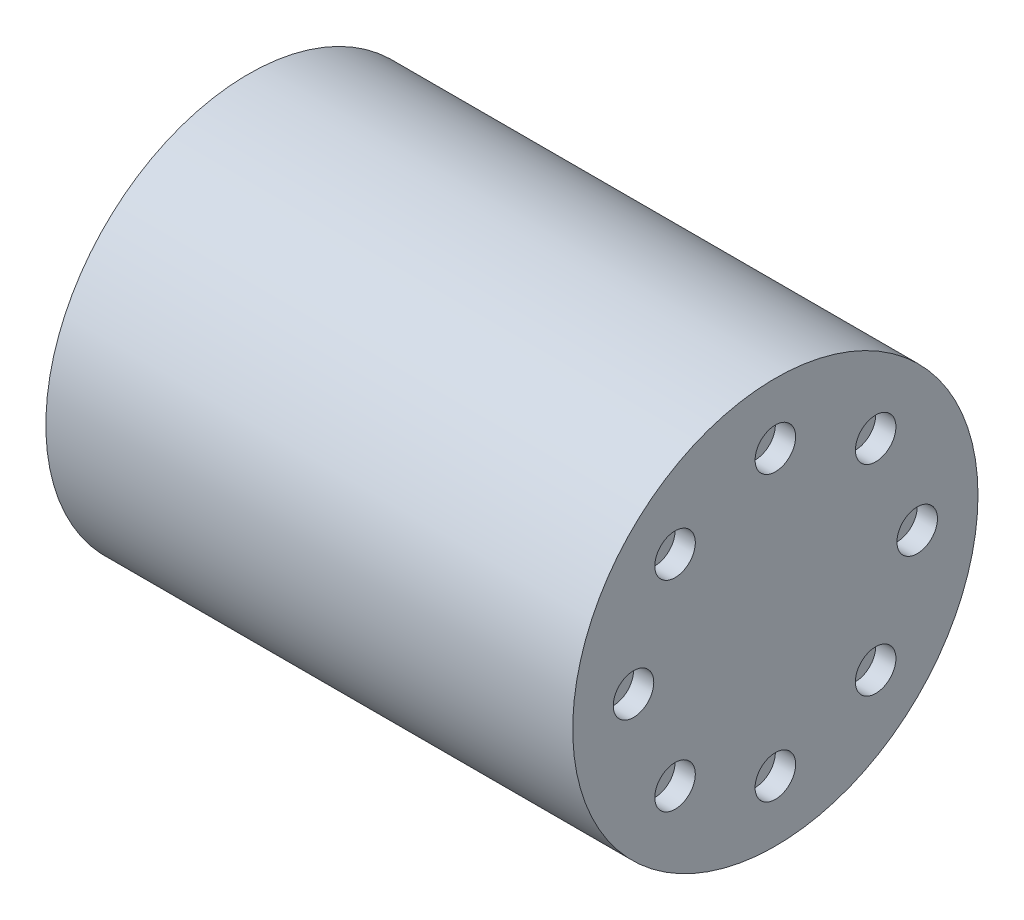
ISO-10303-21;
HEADER;
FILE_DESCRIPTION(('STEP AP214'),'2;1');
FILE_NAME('part.step','',(''),(''),'','','');
FILE_SCHEMA(('AUTOMOTIVE_DESIGN { 1 0 10303 214 1 1 1 1 }'));
ENDSEC;
DATA;
#1=APPLICATION_CONTEXT('core data for automotive mechanical design processes');
#2=APPLICATION_PROTOCOL_DEFINITION('international standard','automotive_design',2000,#1);
#3=PRODUCT_CONTEXT('',#1,'mechanical');
#4=PRODUCT('Part','Part','',(#3));
#5=PRODUCT_RELATED_PRODUCT_CATEGORY('part','',(#4));
#6=PRODUCT_DEFINITION_FORMATION('','',#4);
#7=PRODUCT_DEFINITION_CONTEXT('part definition',#1,'design');
#8=PRODUCT_DEFINITION('design','',#6,#7);
#9=PRODUCT_DEFINITION_SHAPE('','',#8);
#10=(LENGTH_UNIT() NAMED_UNIT(*) SI_UNIT(.MILLI.,.METRE.));
#11=(NAMED_UNIT(*) PLANE_ANGLE_UNIT() SI_UNIT($,.RADIAN.));
#12=(NAMED_UNIT(*) SI_UNIT($,.STERADIAN.) SOLID_ANGLE_UNIT());
#13=UNCERTAINTY_MEASURE_WITH_UNIT(LENGTH_MEASURE(1.E-05),#10,'distance_accuracy_value','');
#14=(GEOMETRIC_REPRESENTATION_CONTEXT(3) GLOBAL_UNCERTAINTY_ASSIGNED_CONTEXT((#13)) GLOBAL_UNIT_ASSIGNED_CONTEXT((#10,
#11,#12)) REPRESENTATION_CONTEXT('',''));
#15=CARTESIAN_POINT('',(0.,0.,0.));
#16=DIRECTION('',(0.,0.,1.));
#17=DIRECTION('',(1.,0.,0.));
#18=AXIS2_PLACEMENT_3D('',#15,#16,#17);
#19=CARTESIAN_POINT('',(65.,0.,0.));
#20=DIRECTION('',(-1.,0.,0.));
#21=DIRECTION('',(0.,0.,1.));
#22=AXIS2_PLACEMENT_3D('',#19,#20,#21);
#23=CYLINDRICAL_SURFACE('',#22,50.);
#24=CARTESIAN_POINT('',(65.,0.,0.));
#25=DIRECTION('',(1.,0.,0.));
#26=DIRECTION('',(0.,0.,-1.));
#27=AXIS2_PLACEMENT_3D('',#24,#25,#26);
#28=CIRCLE('',#27,50.);
#29=CARTESIAN_POINT('',(65.,0.,-50.));
#30=VERTEX_POINT('',#29);
#31=EDGE_CURVE('E41',#30,#30,#28,.T.);
#32=ORIENTED_EDGE('',*,*,#31,.F.);
#33=EDGE_LOOP('',(#32));
#34=FACE_BOUND('',#33,.T.);
#35=CARTESIAN_POINT('',(-65.,0.,0.));
#36=DIRECTION('',(1.,0.,0.));
#37=DIRECTION('',(0.,0.,-1.));
#38=AXIS2_PLACEMENT_3D('',#35,#36,#37);
#39=CIRCLE('',#38,50.);
#40=CARTESIAN_POINT('',(-65.,0.,-50.));
#41=VERTEX_POINT('',#40);
#42=EDGE_CURVE('E45',#41,#41,#39,.T.);
#43=ORIENTED_EDGE('',*,*,#42,.T.);
#44=EDGE_LOOP('',(#43));
#45=FACE_BOUND('',#44,.T.);
#46=ADVANCED_FACE('F35',(#34,#45),#23,.T.);
#47=CARTESIAN_POINT('',(65.,0.,0.));
#48=DIRECTION('',(1.,0.,0.));
#49=DIRECTION('',(0.,0.,-1.));
#50=AXIS2_PLACEMENT_3D('',#47,#48,#49);
#51=PLANE('',#50);
#52=CARTESIAN_POINT('',(65.,24.7487373415295,-24.7487373415289));
#53=DIRECTION('',(1.,0.,0.));
#54=DIRECTION('',(0.,-0.707106781186539,-0.707106781186556));
#55=AXIS2_PLACEMENT_3D('',#52,#53,#54);
#56=CIRCLE('',#55,5.);
#57=CARTESIAN_POINT('',(65.,21.2132034355968,-28.2842712474616));
#58=VERTEX_POINT('',#57);
#59=EDGE_CURVE('E145',#58,#58,#56,.T.);
#60=ORIENTED_EDGE('',*,*,#59,.F.);
#61=EDGE_LOOP('',(#60));
#62=FACE_BOUND('',#61,.T.);
#63=CARTESIAN_POINT('',(65.,3.66605540578529E-13,-35.));
#64=DIRECTION('',(1.,0.,0.));
#65=DIRECTION('',(0.,-1.,0.));
#66=AXIS2_PLACEMENT_3D('',#63,#64,#65);
#67=CIRCLE('',#66,5.);
#68=CARTESIAN_POINT('',(65.,-4.99999999999963,-35.0000000000001));
#69=VERTEX_POINT('',#68);
#70=EDGE_CURVE('E139',#69,#69,#67,.T.);
#71=ORIENTED_EDGE('',*,*,#70,.F.);
#72=EDGE_LOOP('',(#71));
#73=FACE_BOUND('',#72,.T.);
#74=CARTESIAN_POINT('',(65.,-24.748737341529,-24.7487373415294));
#75=DIRECTION('',(1.,0.,0.));
#76=DIRECTION('',(0.,-0.707106781186554,0.707106781186541));
#77=AXIS2_PLACEMENT_3D('',#74,#75,#76);
#78=CIRCLE('',#77,5.);
#79=CARTESIAN_POINT('',(65.,-28.2842712474617,-21.2132034355967));
#80=VERTEX_POINT('',#79);
#81=EDGE_CURVE('E133',#80,#80,#78,.T.);
#82=ORIENTED_EDGE('',*,*,#81,.F.);
#83=EDGE_LOOP('',(#82));
#84=FACE_BOUND('',#83,.T.);
#85=CARTESIAN_POINT('',(65.,-35.,0.));
#86=DIRECTION('',(1.,0.,0.));
#87=DIRECTION('',(0.,0.,1.));
#88=AXIS2_PLACEMENT_3D('',#85,#86,#87);
#89=CIRCLE('',#88,5.);
#90=CARTESIAN_POINT('',(65.,-35.,5.));
#91=VERTEX_POINT('',#90);
#92=EDGE_CURVE('E127',#91,#91,#89,.T.);
#93=ORIENTED_EDGE('',*,*,#92,.F.);
#94=EDGE_LOOP('',(#93));
#95=FACE_BOUND('',#94,.T.);
#96=CARTESIAN_POINT('',(65.,-24.7487373415293,24.748737341529));
#97=DIRECTION('',(1.,0.,0.));
#98=DIRECTION('',(0.,0.707106781186544,0.707106781186551));
#99=AXIS2_PLACEMENT_3D('',#96,#97,#98);
#100=CIRCLE('',#99,5.);
#101=CARTESIAN_POINT('',(65.,-21.2132034355966,28.2842712474618));
#102=VERTEX_POINT('',#101);
#103=EDGE_CURVE('E121',#102,#102,#100,.T.);
#104=ORIENTED_EDGE('',*,*,#103,.F.);
#105=EDGE_LOOP('',(#104));
#106=FACE_BOUND('',#105,.T.);
#107=CARTESIAN_POINT('',(65.,-1.2220184685951E-13,35.));
#108=DIRECTION('',(1.,0.,0.));
#109=DIRECTION('',(0.,1.,0.));
#110=AXIS2_PLACEMENT_3D('',#107,#108,#109);
#111=CIRCLE('',#110,5.);
#112=CARTESIAN_POINT('',(65.,4.99999999999988,35.));
#113=VERTEX_POINT('',#112);
#114=EDGE_CURVE('E115',#113,#113,#111,.T.);
#115=ORIENTED_EDGE('',*,*,#114,.F.);
#116=EDGE_LOOP('',(#115));
#117=FACE_BOUND('',#116,.T.);
#118=CARTESIAN_POINT('',(65.,24.7487373415291,24.7487373415292));
#119=DIRECTION('',(1.,0.,0.));
#120=DIRECTION('',(0.,0.707106781186549,-0.707106781186546));
#121=AXIS2_PLACEMENT_3D('',#118,#119,#120);
#122=CIRCLE('',#121,5.);
#123=CARTESIAN_POINT('',(65.,28.2842712474619,21.2132034355965));
#124=VERTEX_POINT('',#123);
#125=EDGE_CURVE('E109',#124,#124,#122,.T.);
#126=ORIENTED_EDGE('',*,*,#125,.F.);
#127=EDGE_LOOP('',(#126));
#128=FACE_BOUND('',#127,.T.);
#129=CARTESIAN_POINT('',(65.,35.,0.));
#130=DIRECTION('',(1.,0.,0.));
#131=DIRECTION('',(0.,0.,-1.));
#132=AXIS2_PLACEMENT_3D('',#129,#130,#131);
#133=CIRCLE('',#132,5.);
#134=CARTESIAN_POINT('',(65.,35.,-5.));
#135=VERTEX_POINT('',#134);
#136=EDGE_CURVE('E103',#135,#135,#133,.T.);
#137=ORIENTED_EDGE('',*,*,#136,.F.);
#138=EDGE_LOOP('',(#137));
#139=FACE_BOUND('',#138,.T.);
#140=ORIENTED_EDGE('',*,*,#31,.T.);
#141=EDGE_LOOP('',(#140));
#142=FACE_BOUND('',#141,.T.);
#143=ADVANCED_FACE('F160',(#62,#73,#84,#95,#106,#117,#128,#139,#142),#51,.T.);
#144=CARTESIAN_POINT('',(-65.,0.,0.));
#145=DIRECTION('',(1.,0.,0.));
#146=DIRECTION('',(0.,0.,-1.));
#147=AXIS2_PLACEMENT_3D('',#144,#145,#146);
#148=PLANE('',#147);
#149=CARTESIAN_POINT('',(-65.,24.7487373415295,24.7487373415289));
#150=DIRECTION('',(-1.,0.,0.));
#151=DIRECTION('',(0.,-0.707106781186539,0.707106781186556));
#152=AXIS2_PLACEMENT_3D('',#149,#150,#151);
#153=CIRCLE('',#152,5.);
#154=CARTESIAN_POINT('',(-65.,21.2132034355968,28.2842712474616));
#155=VERTEX_POINT('',#154);
#156=EDGE_CURVE('E97',#155,#155,#153,.T.);
#157=ORIENTED_EDGE('',*,*,#156,.F.);
#158=EDGE_LOOP('',(#157));
#159=FACE_BOUND('',#158,.T.);
#160=CARTESIAN_POINT('',(-65.,3.66605540578529E-13,35.));
#161=DIRECTION('',(-1.,0.,0.));
#162=DIRECTION('',(0.,-1.,0.));
#163=AXIS2_PLACEMENT_3D('',#160,#161,#162);
#164=CIRCLE('',#163,5.);
#165=CARTESIAN_POINT('',(-65.,-4.99999999999963,35.0000000000001));
#166=VERTEX_POINT('',#165);
#167=EDGE_CURVE('E91',#166,#166,#164,.T.);
#168=ORIENTED_EDGE('',*,*,#167,.F.);
#169=EDGE_LOOP('',(#168));
#170=FACE_BOUND('',#169,.T.);
#171=CARTESIAN_POINT('',(-65.,-24.748737341529,24.7487373415294));
#172=DIRECTION('',(-1.,0.,0.));
#173=DIRECTION('',(0.,-0.707106781186554,-0.707106781186541));
#174=AXIS2_PLACEMENT_3D('',#171,#172,#173);
#175=CIRCLE('',#174,5.);
#176=CARTESIAN_POINT('',(-65.,-28.2842712474617,21.2132034355967));
#177=VERTEX_POINT('',#176);
#178=EDGE_CURVE('E85',#177,#177,#175,.T.);
#179=ORIENTED_EDGE('',*,*,#178,.F.);
#180=EDGE_LOOP('',(#179));
#181=FACE_BOUND('',#180,.T.);
#182=CARTESIAN_POINT('',(-65.,-35.,0.));
#183=DIRECTION('',(-1.,0.,0.));
#184=DIRECTION('',(0.,0.,-1.));
#185=AXIS2_PLACEMENT_3D('',#182,#183,#184);
#186=CIRCLE('',#185,5.);
#187=CARTESIAN_POINT('',(-65.,-35.,-5.));
#188=VERTEX_POINT('',#187);
#189=EDGE_CURVE('E79',#188,#188,#186,.T.);
#190=ORIENTED_EDGE('',*,*,#189,.F.);
#191=EDGE_LOOP('',(#190));
#192=FACE_BOUND('',#191,.T.);
#193=CARTESIAN_POINT('',(-65.,-24.7487373415293,-24.748737341529));
#194=DIRECTION('',(-1.,0.,0.));
#195=DIRECTION('',(0.,0.707106781186544,-0.707106781186551));
#196=AXIS2_PLACEMENT_3D('',#193,#194,#195);
#197=CIRCLE('',#196,5.);
#198=CARTESIAN_POINT('',(-65.,-21.2132034355966,-28.2842712474618));
#199=VERTEX_POINT('',#198);
#200=EDGE_CURVE('E73',#199,#199,#197,.T.);
#201=ORIENTED_EDGE('',*,*,#200,.F.);
#202=EDGE_LOOP('',(#201));
#203=FACE_BOUND('',#202,.T.);
#204=CARTESIAN_POINT('',(-65.,-1.2220184685951E-13,-35.));
#205=DIRECTION('',(-1.,0.,0.));
#206=DIRECTION('',(0.,1.,0.));
#207=AXIS2_PLACEMENT_3D('',#204,#205,#206);
#208=CIRCLE('',#207,5.);
#209=CARTESIAN_POINT('',(-65.,4.99999999999988,-35.));
#210=VERTEX_POINT('',#209);
#211=EDGE_CURVE('E67',#210,#210,#208,.T.);
#212=ORIENTED_EDGE('',*,*,#211,.F.);
#213=EDGE_LOOP('',(#212));
#214=FACE_BOUND('',#213,.T.);
#215=CARTESIAN_POINT('',(-65.,24.7487373415291,-24.7487373415292));
#216=DIRECTION('',(-1.,0.,0.));
#217=DIRECTION('',(0.,0.707106781186549,0.707106781186546));
#218=AXIS2_PLACEMENT_3D('',#215,#216,#217);
#219=CIRCLE('',#218,5.);
#220=CARTESIAN_POINT('',(-65.,28.2842712474619,-21.2132034355965));
#221=VERTEX_POINT('',#220);
#222=EDGE_CURVE('E61',#221,#221,#219,.T.);
#223=ORIENTED_EDGE('',*,*,#222,.F.);
#224=EDGE_LOOP('',(#223));
#225=FACE_BOUND('',#224,.T.);
#226=CARTESIAN_POINT('',(-65.,35.,0.));
#227=DIRECTION('',(-1.,0.,0.));
#228=DIRECTION('',(0.,0.,1.));
#229=AXIS2_PLACEMENT_3D('',#226,#227,#228);
#230=CIRCLE('',#229,5.);
#231=CARTESIAN_POINT('',(-65.,35.,5.));
#232=VERTEX_POINT('',#231);
#233=EDGE_CURVE('E55',#232,#232,#230,.T.);
#234=ORIENTED_EDGE('',*,*,#233,.F.);
#235=EDGE_LOOP('',(#234));
#236=FACE_BOUND('',#235,.T.);
#237=CARTESIAN_POINT('',(-65.,0.,0.));
#238=DIRECTION('',(1.,0.,0.));
#239=DIRECTION('',(0.,0.,-1.));
#240=AXIS2_PLACEMENT_3D('',#237,#238,#239);
#241=CIRCLE('',#240,4.);
#242=CARTESIAN_POINT('',(-65.,0.,-4.));
#243=VERTEX_POINT('',#242);
#244=EDGE_CURVE('E10',#243,#243,#241,.F.);
#245=ORIENTED_EDGE('',*,*,#244,.F.);
#246=EDGE_LOOP('',(#245));
#247=FACE_BOUND('',#246,.T.);
#248=ORIENTED_EDGE('',*,*,#42,.F.);
#249=EDGE_LOOP('',(#248));
#250=FACE_BOUND('',#249,.T.);
#251=ADVANCED_FACE('F163',(#159,#170,#181,#192,#203,#214,#225,#236,#247,#250),#148,.F.);
#252=CARTESIAN_POINT('',(-77.,0.,0.));
#253=DIRECTION('',(1.,0.,0.));
#254=DIRECTION('',(0.,0.,-1.));
#255=AXIS2_PLACEMENT_3D('',#252,#253,#254);
#256=CYLINDRICAL_SURFACE('',#255,4.);
#257=CARTESIAN_POINT('',(-77.,0.,0.));
#258=DIRECTION('',(-1.,0.,0.));
#259=DIRECTION('',(0.,0.,1.));
#260=AXIS2_PLACEMENT_3D('',#257,#258,#259);
#261=CIRCLE('',#260,4.);
#262=CARTESIAN_POINT('',(-77.,0.,4.));
#263=VERTEX_POINT('',#262);
#264=EDGE_CURVE('E50',#263,#263,#261,.T.);
#265=ORIENTED_EDGE('',*,*,#264,.F.);
#266=EDGE_LOOP('',(#265));
#267=FACE_BOUND('',#266,.T.);
#268=ORIENTED_EDGE('',*,*,#244,.T.);
#269=EDGE_LOOP('',(#268));
#270=FACE_BOUND('',#269,.T.);
#271=ADVANCED_FACE('F204',(#267,#270),#256,.T.);
#272=CARTESIAN_POINT('',(-77.,0.,0.));
#273=DIRECTION('',(-1.,0.,0.));
#274=DIRECTION('',(0.,0.,1.));
#275=AXIS2_PLACEMENT_3D('',#272,#273,#274);
#276=PLANE('',#275);
#277=ORIENTED_EDGE('',*,*,#264,.T.);
#278=EDGE_LOOP('',(#277));
#279=FACE_BOUND('',#278,.T.);
#280=ADVANCED_FACE('F209',(#279),#276,.T.);
#281=CARTESIAN_POINT('',(-60.,35.,0.));
#282=DIRECTION('',(-1.,0.,0.));
#283=DIRECTION('',(0.,0.,1.));
#284=AXIS2_PLACEMENT_3D('',#281,#282,#283);
#285=CYLINDRICAL_SURFACE('',#284,5.);
#286=CARTESIAN_POINT('',(-60.,35.,0.));
#287=DIRECTION('',(-1.,0.,0.));
#288=DIRECTION('',(0.,0.,1.));
#289=AXIS2_PLACEMENT_3D('',#286,#287,#288);
#290=CIRCLE('',#289,5.);
#291=CARTESIAN_POINT('',(-60.,35.,5.));
#292=VERTEX_POINT('',#291);
#293=EDGE_CURVE('E54',#292,#292,#290,.T.);
#294=ORIENTED_EDGE('',*,*,#293,.F.);
#295=EDGE_LOOP('',(#294));
#296=FACE_BOUND('',#295,.T.);
#297=ORIENTED_EDGE('',*,*,#233,.T.);
#298=EDGE_LOOP('',(#297));
#299=FACE_BOUND('',#298,.T.);
#300=ADVANCED_FACE('F217',(#296,#299),#285,.F.);
#301=CARTESIAN_POINT('',(-60.,35.,0.));
#302=DIRECTION('',(-1.,0.,0.));
#303=DIRECTION('',(0.,0.,1.));
#304=AXIS2_PLACEMENT_3D('',#301,#302,#303);
#305=PLANE('',#304);
#306=ORIENTED_EDGE('',*,*,#293,.T.);
#307=EDGE_LOOP('',(#306));
#308=FACE_BOUND('',#307,.T.);
#309=ADVANCED_FACE('F221',(#308),#305,.T.);
#310=CARTESIAN_POINT('',(-60.,24.7487373415291,-24.7487373415292));
#311=DIRECTION('',(-1.,0.,0.));
#312=DIRECTION('',(0.,0.,1.));
#313=AXIS2_PLACEMENT_3D('',#310,#311,#312);
#314=CYLINDRICAL_SURFACE('',#313,5.);
#315=CARTESIAN_POINT('',(-60.,24.7487373415291,-24.7487373415292));
#316=DIRECTION('',(-1.,0.,0.));
#317=DIRECTION('',(0.,0.707106781186549,0.707106781186546));
#318=AXIS2_PLACEMENT_3D('',#315,#316,#317);
#319=CIRCLE('',#318,5.);
#320=CARTESIAN_POINT('',(-60.,28.2842712474619,-21.2132034355965));
#321=VERTEX_POINT('',#320);
#322=EDGE_CURVE('E58',#321,#321,#319,.T.);
#323=ORIENTED_EDGE('',*,*,#322,.F.);
#324=EDGE_LOOP('',(#323));
#325=FACE_BOUND('',#324,.T.);
#326=ORIENTED_EDGE('',*,*,#222,.T.);
#327=EDGE_LOOP('',(#326));
#328=FACE_BOUND('',#327,.T.);
#329=ADVANCED_FACE('F225',(#325,#328),#314,.F.);
#330=CARTESIAN_POINT('',(-60.,24.7487373415291,-24.7487373415292));
#331=DIRECTION('',(-1.,0.,0.));
#332=DIRECTION('',(0.,0.707106781186549,0.707106781186546));
#333=AXIS2_PLACEMENT_3D('',#330,#331,#332);
#334=PLANE('',#333);
#335=ORIENTED_EDGE('',*,*,#322,.T.);
#336=EDGE_LOOP('',(#335));
#337=FACE_BOUND('',#336,.T.);
#338=ADVANCED_FACE('F229',(#337),#334,.T.);
#339=CARTESIAN_POINT('',(-60.,-1.2220184685951E-13,-35.));
#340=DIRECTION('',(-1.,0.,0.));
#341=DIRECTION('',(0.,0.,1.));
#342=AXIS2_PLACEMENT_3D('',#339,#340,#341);
#343=CYLINDRICAL_SURFACE('',#342,5.);
#344=CARTESIAN_POINT('',(-60.,-1.2220184685951E-13,-35.));
#345=DIRECTION('',(-1.,0.,0.));
#346=DIRECTION('',(0.,1.,0.));
#347=AXIS2_PLACEMENT_3D('',#344,#345,#346);
#348=CIRCLE('',#347,5.);
#349=CARTESIAN_POINT('',(-60.,4.99999999999988,-35.));
#350=VERTEX_POINT('',#349);
#351=EDGE_CURVE('E64',#350,#350,#348,.T.);
#352=ORIENTED_EDGE('',*,*,#351,.F.);
#353=EDGE_LOOP('',(#352));
#354=FACE_BOUND('',#353,.T.);
#355=ORIENTED_EDGE('',*,*,#211,.T.);
#356=EDGE_LOOP('',(#355));
#357=FACE_BOUND('',#356,.T.);
#358=ADVANCED_FACE('F233',(#354,#357),#343,.F.);
#359=CARTESIAN_POINT('',(-60.,-1.2220184685951E-13,-35.));
#360=DIRECTION('',(-1.,0.,0.));
#361=DIRECTION('',(0.,1.,0.));
#362=AXIS2_PLACEMENT_3D('',#359,#360,#361);
#363=PLANE('',#362);
#364=ORIENTED_EDGE('',*,*,#351,.T.);
#365=EDGE_LOOP('',(#364));
#366=FACE_BOUND('',#365,.T.);
#367=ADVANCED_FACE('F237',(#366),#363,.T.);
#368=CARTESIAN_POINT('',(-60.,-24.7487373415293,-24.748737341529));
#369=DIRECTION('',(-1.,0.,0.));
#370=DIRECTION('',(0.,0.,1.));
#371=AXIS2_PLACEMENT_3D('',#368,#369,#370);
#372=CYLINDRICAL_SURFACE('',#371,5.);
#373=CARTESIAN_POINT('',(-60.,-24.7487373415293,-24.748737341529));
#374=DIRECTION('',(-1.,0.,0.));
#375=DIRECTION('',(0.,0.707106781186544,-0.707106781186551));
#376=AXIS2_PLACEMENT_3D('',#373,#374,#375);
#377=CIRCLE('',#376,5.);
#378=CARTESIAN_POINT('',(-60.,-21.2132034355966,-28.2842712474618));
#379=VERTEX_POINT('',#378);
#380=EDGE_CURVE('E70',#379,#379,#377,.T.);
#381=ORIENTED_EDGE('',*,*,#380,.F.);
#382=EDGE_LOOP('',(#381));
#383=FACE_BOUND('',#382,.T.);
#384=ORIENTED_EDGE('',*,*,#200,.T.);
#385=EDGE_LOOP('',(#384));
#386=FACE_BOUND('',#385,.T.);
#387=ADVANCED_FACE('F241',(#383,#386),#372,.F.);
#388=CARTESIAN_POINT('',(-60.,-24.7487373415293,-24.748737341529));
#389=DIRECTION('',(-1.,0.,0.));
#390=DIRECTION('',(0.,0.707106781186544,-0.707106781186551));
#391=AXIS2_PLACEMENT_3D('',#388,#389,#390);
#392=PLANE('',#391);
#393=ORIENTED_EDGE('',*,*,#380,.T.);
#394=EDGE_LOOP('',(#393));
#395=FACE_BOUND('',#394,.T.);
#396=ADVANCED_FACE('F245',(#395),#392,.T.);
#397=CARTESIAN_POINT('',(-60.,-35.,0.));
#398=DIRECTION('',(-1.,0.,0.));
#399=DIRECTION('',(0.,0.,1.));
#400=AXIS2_PLACEMENT_3D('',#397,#398,#399);
#401=CYLINDRICAL_SURFACE('',#400,5.);
#402=CARTESIAN_POINT('',(-60.,-35.,0.));
#403=DIRECTION('',(-1.,0.,0.));
#404=DIRECTION('',(0.,0.,-1.));
#405=AXIS2_PLACEMENT_3D('',#402,#403,#404);
#406=CIRCLE('',#405,5.);
#407=CARTESIAN_POINT('',(-60.,-35.,-5.));
#408=VERTEX_POINT('',#407);
#409=EDGE_CURVE('E76',#408,#408,#406,.T.);
#410=ORIENTED_EDGE('',*,*,#409,.F.);
#411=EDGE_LOOP('',(#410));
#412=FACE_BOUND('',#411,.T.);
#413=ORIENTED_EDGE('',*,*,#189,.T.);
#414=EDGE_LOOP('',(#413));
#415=FACE_BOUND('',#414,.T.);
#416=ADVANCED_FACE('F249',(#412,#415),#401,.F.);
#417=CARTESIAN_POINT('',(-60.,-35.,0.));
#418=DIRECTION('',(-1.,0.,0.));
#419=DIRECTION('',(0.,0.,-1.));
#420=AXIS2_PLACEMENT_3D('',#417,#418,#419);
#421=PLANE('',#420);
#422=ORIENTED_EDGE('',*,*,#409,.T.);
#423=EDGE_LOOP('',(#422));
#424=FACE_BOUND('',#423,.T.);
#425=ADVANCED_FACE('F253',(#424),#421,.T.);
#426=CARTESIAN_POINT('',(-60.,-24.748737341529,24.7487373415294));
#427=DIRECTION('',(-1.,0.,0.));
#428=DIRECTION('',(0.,0.,1.));
#429=AXIS2_PLACEMENT_3D('',#426,#427,#428);
#430=CYLINDRICAL_SURFACE('',#429,5.);
#431=CARTESIAN_POINT('',(-60.,-24.748737341529,24.7487373415294));
#432=DIRECTION('',(-1.,0.,0.));
#433=DIRECTION('',(0.,-0.707106781186554,-0.707106781186541));
#434=AXIS2_PLACEMENT_3D('',#431,#432,#433);
#435=CIRCLE('',#434,5.);
#436=CARTESIAN_POINT('',(-60.,-28.2842712474617,21.2132034355967));
#437=VERTEX_POINT('',#436);
#438=EDGE_CURVE('E82',#437,#437,#435,.T.);
#439=ORIENTED_EDGE('',*,*,#438,.F.);
#440=EDGE_LOOP('',(#439));
#441=FACE_BOUND('',#440,.T.);
#442=ORIENTED_EDGE('',*,*,#178,.T.);
#443=EDGE_LOOP('',(#442));
#444=FACE_BOUND('',#443,.T.);
#445=ADVANCED_FACE('F257',(#441,#444),#430,.F.);
#446=CARTESIAN_POINT('',(-60.,-24.748737341529,24.7487373415294));
#447=DIRECTION('',(-1.,0.,0.));
#448=DIRECTION('',(0.,-0.707106781186554,-0.707106781186541));
#449=AXIS2_PLACEMENT_3D('',#446,#447,#448);
#450=PLANE('',#449);
#451=ORIENTED_EDGE('',*,*,#438,.T.);
#452=EDGE_LOOP('',(#451));
#453=FACE_BOUND('',#452,.T.);
#454=ADVANCED_FACE('F261',(#453),#450,.T.);
#455=CARTESIAN_POINT('',(-60.,3.66605540578529E-13,35.));
#456=DIRECTION('',(-1.,0.,0.));
#457=DIRECTION('',(0.,0.,1.));
#458=AXIS2_PLACEMENT_3D('',#455,#456,#457);
#459=CYLINDRICAL_SURFACE('',#458,5.);
#460=CARTESIAN_POINT('',(-60.,3.66605540578529E-13,35.));
#461=DIRECTION('',(-1.,0.,0.));
#462=DIRECTION('',(0.,-1.,0.));
#463=AXIS2_PLACEMENT_3D('',#460,#461,#462);
#464=CIRCLE('',#463,5.);
#465=CARTESIAN_POINT('',(-60.,-4.99999999999963,35.0000000000001));
#466=VERTEX_POINT('',#465);
#467=EDGE_CURVE('E88',#466,#466,#464,.T.);
#468=ORIENTED_EDGE('',*,*,#467,.F.);
#469=EDGE_LOOP('',(#468));
#470=FACE_BOUND('',#469,.T.);
#471=ORIENTED_EDGE('',*,*,#167,.T.);
#472=EDGE_LOOP('',(#471));
#473=FACE_BOUND('',#472,.T.);
#474=ADVANCED_FACE('F265',(#470,#473),#459,.F.);
#475=CARTESIAN_POINT('',(-60.,3.66605540578529E-13,35.));
#476=DIRECTION('',(-1.,0.,0.));
#477=DIRECTION('',(0.,-1.,0.));
#478=AXIS2_PLACEMENT_3D('',#475,#476,#477);
#479=PLANE('',#478);
#480=ORIENTED_EDGE('',*,*,#467,.T.);
#481=EDGE_LOOP('',(#480));
#482=FACE_BOUND('',#481,.T.);
#483=ADVANCED_FACE('F269',(#482),#479,.T.);
#484=CARTESIAN_POINT('',(-60.,24.7487373415295,24.7487373415289));
#485=DIRECTION('',(-1.,0.,0.));
#486=DIRECTION('',(0.,0.,1.));
#487=AXIS2_PLACEMENT_3D('',#484,#485,#486);
#488=CYLINDRICAL_SURFACE('',#487,5.);
#489=CARTESIAN_POINT('',(-60.,24.7487373415295,24.7487373415289));
#490=DIRECTION('',(-1.,0.,0.));
#491=DIRECTION('',(0.,-0.707106781186539,0.707106781186556));
#492=AXIS2_PLACEMENT_3D('',#489,#490,#491);
#493=CIRCLE('',#492,5.);
#494=CARTESIAN_POINT('',(-60.,21.2132034355968,28.2842712474616));
#495=VERTEX_POINT('',#494);
#496=EDGE_CURVE('E94',#495,#495,#493,.T.);
#497=ORIENTED_EDGE('',*,*,#496,.F.);
#498=EDGE_LOOP('',(#497));
#499=FACE_BOUND('',#498,.T.);
#500=ORIENTED_EDGE('',*,*,#156,.T.);
#501=EDGE_LOOP('',(#500));
#502=FACE_BOUND('',#501,.T.);
#503=ADVANCED_FACE('F192',(#499,#502),#488,.F.);
#504=CARTESIAN_POINT('',(-60.,24.7487373415295,24.7487373415289));
#505=DIRECTION('',(-1.,0.,0.));
#506=DIRECTION('',(0.,-0.707106781186539,0.707106781186556));
#507=AXIS2_PLACEMENT_3D('',#504,#505,#506);
#508=PLANE('',#507);
#509=ORIENTED_EDGE('',*,*,#496,.T.);
#510=EDGE_LOOP('',(#509));
#511=FACE_BOUND('',#510,.T.);
#512=ADVANCED_FACE('F182',(#511),#508,.T.);
#513=CARTESIAN_POINT('',(60.,35.,0.));
#514=DIRECTION('',(1.,0.,0.));
#515=DIRECTION('',(0.,0.,-1.));
#516=AXIS2_PLACEMENT_3D('',#513,#514,#515);
#517=CYLINDRICAL_SURFACE('',#516,5.);
#518=CARTESIAN_POINT('',(60.,35.,0.));
#519=DIRECTION('',(1.,0.,0.));
#520=DIRECTION('',(0.,0.,-1.));
#521=AXIS2_PLACEMENT_3D('',#518,#519,#520);
#522=CIRCLE('',#521,5.);
#523=CARTESIAN_POINT('',(60.,35.,-5.));
#524=VERTEX_POINT('',#523);
#525=EDGE_CURVE('E100',#524,#524,#522,.T.);
#526=ORIENTED_EDGE('',*,*,#525,.F.);
#527=EDGE_LOOP('',(#526));
#528=FACE_BOUND('',#527,.T.);
#529=ORIENTED_EDGE('',*,*,#136,.T.);
#530=EDGE_LOOP('',(#529));
#531=FACE_BOUND('',#530,.T.);
#532=ADVANCED_FACE('F179',(#528,#531),#517,.F.);
#533=CARTESIAN_POINT('',(60.,35.,0.));
#534=DIRECTION('',(1.,0.,0.));
#535=DIRECTION('',(0.,0.,-1.));
#536=AXIS2_PLACEMENT_3D('',#533,#534,#535);
#537=PLANE('',#536);
#538=ORIENTED_EDGE('',*,*,#525,.T.);
#539=EDGE_LOOP('',(#538));
#540=FACE_BOUND('',#539,.T.);
#541=ADVANCED_FACE('F181',(#540),#537,.T.);
#542=CARTESIAN_POINT('',(60.,24.7487373415291,24.7487373415292));
#543=DIRECTION('',(1.,0.,0.));
#544=DIRECTION('',(0.,0.,-1.));
#545=AXIS2_PLACEMENT_3D('',#542,#543,#544);
#546=CYLINDRICAL_SURFACE('',#545,5.);
#547=CARTESIAN_POINT('',(60.,24.7487373415291,24.7487373415292));
#548=DIRECTION('',(1.,0.,0.));
#549=DIRECTION('',(0.,0.707106781186549,-0.707106781186546));
#550=AXIS2_PLACEMENT_3D('',#547,#548,#549);
#551=CIRCLE('',#550,5.);
#552=CARTESIAN_POINT('',(60.,28.2842712474619,21.2132034355965));
#553=VERTEX_POINT('',#552);
#554=EDGE_CURVE('E106',#553,#553,#551,.T.);
#555=ORIENTED_EDGE('',*,*,#554,.F.);
#556=EDGE_LOOP('',(#555));
#557=FACE_BOUND('',#556,.T.);
#558=ORIENTED_EDGE('',*,*,#125,.T.);
#559=EDGE_LOOP('',(#558));
#560=FACE_BOUND('',#559,.T.);
#561=ADVANCED_FACE('F189',(#557,#560),#546,.F.);
#562=CARTESIAN_POINT('',(60.,24.7487373415291,24.7487373415292));
#563=DIRECTION('',(1.,0.,0.));
#564=DIRECTION('',(0.,0.707106781186549,-0.707106781186546));
#565=AXIS2_PLACEMENT_3D('',#562,#563,#564);
#566=PLANE('',#565);
#567=ORIENTED_EDGE('',*,*,#554,.T.);
#568=EDGE_LOOP('',(#567));
#569=FACE_BOUND('',#568,.T.);
#570=ADVANCED_FACE('F313',(#569),#566,.T.);
#571=CARTESIAN_POINT('',(60.,-1.2220184685951E-13,35.));
#572=DIRECTION('',(1.,0.,0.));
#573=DIRECTION('',(0.,0.,-1.));
#574=AXIS2_PLACEMENT_3D('',#571,#572,#573);
#575=CYLINDRICAL_SURFACE('',#574,5.);
#576=CARTESIAN_POINT('',(60.,-1.2220184685951E-13,35.));
#577=DIRECTION('',(1.,0.,0.));
#578=DIRECTION('',(0.,1.,0.));
#579=AXIS2_PLACEMENT_3D('',#576,#577,#578);
#580=CIRCLE('',#579,5.);
#581=CARTESIAN_POINT('',(60.,4.99999999999988,35.));
#582=VERTEX_POINT('',#581);
#583=EDGE_CURVE('E112',#582,#582,#580,.T.);
#584=ORIENTED_EDGE('',*,*,#583,.F.);
#585=EDGE_LOOP('',(#584));
#586=FACE_BOUND('',#585,.T.);
#587=ORIENTED_EDGE('',*,*,#114,.T.);
#588=EDGE_LOOP('',(#587));
#589=FACE_BOUND('',#588,.T.);
#590=ADVANCED_FACE('F323',(#586,#589),#575,.F.);
#591=CARTESIAN_POINT('',(60.,-1.2220184685951E-13,35.));
#592=DIRECTION('',(1.,0.,0.));
#593=DIRECTION('',(0.,1.,0.));
#594=AXIS2_PLACEMENT_3D('',#591,#592,#593);
#595=PLANE('',#594);
#596=ORIENTED_EDGE('',*,*,#583,.T.);
#597=EDGE_LOOP('',(#596));
#598=FACE_BOUND('',#597,.T.);
#599=ADVANCED_FACE('F333',(#598),#595,.T.);
#600=CARTESIAN_POINT('',(60.,-24.7487373415293,24.748737341529));
#601=DIRECTION('',(1.,0.,0.));
#602=DIRECTION('',(0.,0.,-1.));
#603=AXIS2_PLACEMENT_3D('',#600,#601,#602);
#604=CYLINDRICAL_SURFACE('',#603,5.);
#605=CARTESIAN_POINT('',(60.,-24.7487373415293,24.748737341529));
#606=DIRECTION('',(1.,0.,0.));
#607=DIRECTION('',(0.,0.707106781186544,0.707106781186551));
#608=AXIS2_PLACEMENT_3D('',#605,#606,#607);
#609=CIRCLE('',#608,5.);
#610=CARTESIAN_POINT('',(60.,-21.2132034355966,28.2842712474618));
#611=VERTEX_POINT('',#610);
#612=EDGE_CURVE('E118',#611,#611,#609,.T.);
#613=ORIENTED_EDGE('',*,*,#612,.F.);
#614=EDGE_LOOP('',(#613));
#615=FACE_BOUND('',#614,.T.);
#616=ORIENTED_EDGE('',*,*,#103,.T.);
#617=EDGE_LOOP('',(#616));
#618=FACE_BOUND('',#617,.T.);
#619=ADVANCED_FACE('F343',(#615,#618),#604,.F.);
#620=CARTESIAN_POINT('',(60.,-24.7487373415293,24.748737341529));
#621=DIRECTION('',(1.,0.,0.));
#622=DIRECTION('',(0.,0.707106781186544,0.707106781186551));
#623=AXIS2_PLACEMENT_3D('',#620,#621,#622);
#624=PLANE('',#623);
#625=ORIENTED_EDGE('',*,*,#612,.T.);
#626=EDGE_LOOP('',(#625));
#627=FACE_BOUND('',#626,.T.);
#628=ADVANCED_FACE('F353',(#627),#624,.T.);
#629=CARTESIAN_POINT('',(60.,-35.,0.));
#630=DIRECTION('',(1.,0.,0.));
#631=DIRECTION('',(0.,0.,-1.));
#632=AXIS2_PLACEMENT_3D('',#629,#630,#631);
#633=CYLINDRICAL_SURFACE('',#632,5.);
#634=CARTESIAN_POINT('',(60.,-35.,0.));
#635=DIRECTION('',(1.,0.,0.));
#636=DIRECTION('',(0.,0.,1.));
#637=AXIS2_PLACEMENT_3D('',#634,#635,#636);
#638=CIRCLE('',#637,5.);
#639=CARTESIAN_POINT('',(60.,-35.,5.));
#640=VERTEX_POINT('',#639);
#641=EDGE_CURVE('E124',#640,#640,#638,.T.);
#642=ORIENTED_EDGE('',*,*,#641,.F.);
#643=EDGE_LOOP('',(#642));
#644=FACE_BOUND('',#643,.T.);
#645=ORIENTED_EDGE('',*,*,#92,.T.);
#646=EDGE_LOOP('',(#645));
#647=FACE_BOUND('',#646,.T.);
#648=ADVANCED_FACE('F363',(#644,#647),#633,.F.);
#649=CARTESIAN_POINT('',(60.,-35.,0.));
#650=DIRECTION('',(1.,0.,0.));
#651=DIRECTION('',(0.,0.,1.));
#652=AXIS2_PLACEMENT_3D('',#649,#650,#651);
#653=PLANE('',#652);
#654=ORIENTED_EDGE('',*,*,#641,.T.);
#655=EDGE_LOOP('',(#654));
#656=FACE_BOUND('',#655,.T.);
#657=ADVANCED_FACE('F373',(#656),#653,.T.);
#658=CARTESIAN_POINT('',(60.,-24.748737341529,-24.7487373415294));
#659=DIRECTION('',(1.,0.,0.));
#660=DIRECTION('',(0.,0.,-1.));
#661=AXIS2_PLACEMENT_3D('',#658,#659,#660);
#662=CYLINDRICAL_SURFACE('',#661,5.);
#663=CARTESIAN_POINT('',(60.,-24.748737341529,-24.7487373415294));
#664=DIRECTION('',(1.,0.,0.));
#665=DIRECTION('',(0.,-0.707106781186554,0.707106781186541));
#666=AXIS2_PLACEMENT_3D('',#663,#664,#665);
#667=CIRCLE('',#666,5.);
#668=CARTESIAN_POINT('',(60.,-28.2842712474617,-21.2132034355967));
#669=VERTEX_POINT('',#668);
#670=EDGE_CURVE('E130',#669,#669,#667,.T.);
#671=ORIENTED_EDGE('',*,*,#670,.F.);
#672=EDGE_LOOP('',(#671));
#673=FACE_BOUND('',#672,.T.);
#674=ORIENTED_EDGE('',*,*,#81,.T.);
#675=EDGE_LOOP('',(#674));
#676=FACE_BOUND('',#675,.T.);
#677=ADVANCED_FACE('F383',(#673,#676),#662,.F.);
#678=CARTESIAN_POINT('',(60.,-24.748737341529,-24.7487373415294));
#679=DIRECTION('',(1.,0.,0.));
#680=DIRECTION('',(0.,-0.707106781186554,0.707106781186541));
#681=AXIS2_PLACEMENT_3D('',#678,#679,#680);
#682=PLANE('',#681);
#683=ORIENTED_EDGE('',*,*,#670,.T.);
#684=EDGE_LOOP('',(#683));
#685=FACE_BOUND('',#684,.T.);
#686=ADVANCED_FACE('F393',(#685),#682,.T.);
#687=CARTESIAN_POINT('',(60.,3.66605540578529E-13,-35.));
#688=DIRECTION('',(1.,0.,0.));
#689=DIRECTION('',(0.,0.,-1.));
#690=AXIS2_PLACEMENT_3D('',#687,#688,#689);
#691=CYLINDRICAL_SURFACE('',#690,5.);
#692=CARTESIAN_POINT('',(60.,3.66605540578529E-13,-35.));
#693=DIRECTION('',(1.,0.,0.));
#694=DIRECTION('',(0.,-1.,0.));
#695=AXIS2_PLACEMENT_3D('',#692,#693,#694);
#696=CIRCLE('',#695,5.);
#697=CARTESIAN_POINT('',(60.,-4.99999999999963,-35.0000000000001));
#698=VERTEX_POINT('',#697);
#699=EDGE_CURVE('E136',#698,#698,#696,.T.);
#700=ORIENTED_EDGE('',*,*,#699,.F.);
#701=EDGE_LOOP('',(#700));
#702=FACE_BOUND('',#701,.T.);
#703=ORIENTED_EDGE('',*,*,#70,.T.);
#704=EDGE_LOOP('',(#703));
#705=FACE_BOUND('',#704,.T.);
#706=ADVANCED_FACE('F403',(#702,#705),#691,.F.);
#707=CARTESIAN_POINT('',(60.,3.66605540578529E-13,-35.));
#708=DIRECTION('',(1.,0.,0.));
#709=DIRECTION('',(0.,-1.,0.));
#710=AXIS2_PLACEMENT_3D('',#707,#708,#709);
#711=PLANE('',#710);
#712=ORIENTED_EDGE('',*,*,#699,.T.);
#713=EDGE_LOOP('',(#712));
#714=FACE_BOUND('',#713,.T.);
#715=ADVANCED_FACE('F156',(#714),#711,.T.);
#716=CARTESIAN_POINT('',(60.,24.7487373415295,-24.7487373415289));
#717=DIRECTION('',(1.,0.,0.));
#718=DIRECTION('',(0.,0.,-1.));
#719=AXIS2_PLACEMENT_3D('',#716,#717,#718);
#720=CYLINDRICAL_SURFACE('',#719,5.);
#721=CARTESIAN_POINT('',(60.,24.7487373415295,-24.7487373415289));
#722=DIRECTION('',(1.,0.,0.));
#723=DIRECTION('',(0.,-0.707106781186539,-0.707106781186556));
#724=AXIS2_PLACEMENT_3D('',#721,#722,#723);
#725=CIRCLE('',#724,5.);
#726=CARTESIAN_POINT('',(60.,21.2132034355968,-28.2842712474616));
#727=VERTEX_POINT('',#726);
#728=EDGE_CURVE('E142',#727,#727,#725,.T.);
#729=ORIENTED_EDGE('',*,*,#728,.F.);
#730=EDGE_LOOP('',(#729));
#731=FACE_BOUND('',#730,.T.);
#732=ORIENTED_EDGE('',*,*,#59,.T.);
#733=EDGE_LOOP('',(#732));
#734=FACE_BOUND('',#733,.T.);
#735=ADVANCED_FACE('F153',(#731,#734),#720,.F.);
#736=CARTESIAN_POINT('',(60.,24.7487373415295,-24.7487373415289));
#737=DIRECTION('',(1.,0.,0.));
#738=DIRECTION('',(0.,-0.707106781186539,-0.707106781186556));
#739=AXIS2_PLACEMENT_3D('',#736,#737,#738);
#740=PLANE('',#739);
#741=ORIENTED_EDGE('',*,*,#728,.T.);
#742=EDGE_LOOP('',(#741));
#743=FACE_BOUND('',#742,.T.);
#744=ADVANCED_FACE('F151',(#743),#740,.T.);
#745=CLOSED_SHELL('',(#46,#143,#251,#271,#280,#300,#309,#329,#338,#358,#367,#387,#396,#416,#425,
#445,#454,#474,#483,#503,#512,#532,#541,#561,#570,#590,#599,#619,#628,#648,#657,#677,#686,#706,
#715,#735,#744));
#746=MANIFOLD_SOLID_BREP('B2',#745);
#747=ADVANCED_BREP_SHAPE_REPRESENTATION('',(#18,#746),#14);
#748=SHAPE_DEFINITION_REPRESENTATION(#9,#747);
ENDSEC;
END-ISO-10303-21;
